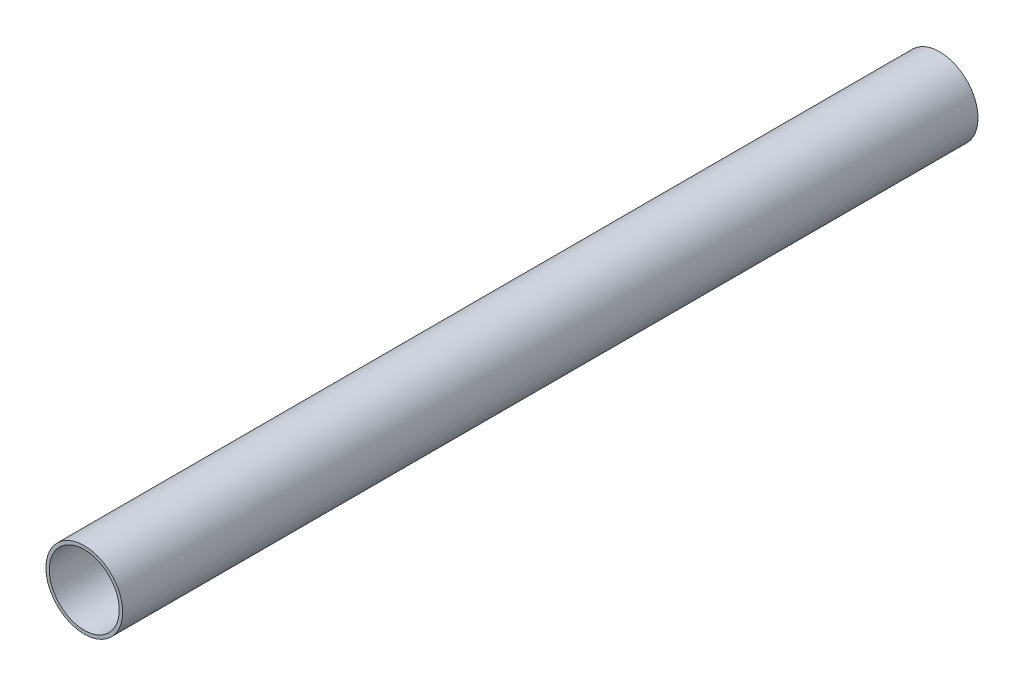
ISO-10303-21;
HEADER;
FILE_DESCRIPTION(('STEP AP214'),'2;1');
FILE_NAME('part.step','',(''),(''),'','','');
FILE_SCHEMA(('AUTOMOTIVE_DESIGN { 1 0 10303 214 1 1 1 1 }'));
ENDSEC;
DATA;
#1=APPLICATION_CONTEXT('core data for automotive mechanical design processes');
#2=APPLICATION_PROTOCOL_DEFINITION('international standard','automotive_design',2000,#1);
#3=PRODUCT_CONTEXT('',#1,'mechanical');
#4=PRODUCT('Part','Part','',(#3));
#5=PRODUCT_RELATED_PRODUCT_CATEGORY('part','',(#4));
#6=PRODUCT_DEFINITION_FORMATION('','',#4);
#7=PRODUCT_DEFINITION_CONTEXT('part definition',#1,'design');
#8=PRODUCT_DEFINITION('design','',#6,#7);
#9=PRODUCT_DEFINITION_SHAPE('','',#8);
#10=(LENGTH_UNIT() NAMED_UNIT(*) SI_UNIT(.MILLI.,.METRE.));
#11=(NAMED_UNIT(*) PLANE_ANGLE_UNIT() SI_UNIT($,.RADIAN.));
#12=(NAMED_UNIT(*) SI_UNIT($,.STERADIAN.) SOLID_ANGLE_UNIT());
#13=UNCERTAINTY_MEASURE_WITH_UNIT(LENGTH_MEASURE(1.E-05),#10,'distance_accuracy_value','');
#14=(GEOMETRIC_REPRESENTATION_CONTEXT(3) GLOBAL_UNCERTAINTY_ASSIGNED_CONTEXT((#13)) GLOBAL_UNIT_ASSIGNED_CONTEXT((#10,
#11,#12)) REPRESENTATION_CONTEXT('',''));
#15=CARTESIAN_POINT('',(0.,0.,0.));
#16=DIRECTION('',(0.,0.,1.));
#17=DIRECTION('',(1.,0.,0.));
#18=AXIS2_PLACEMENT_3D('',#15,#16,#17);
#19=CARTESIAN_POINT('',(0.,0.,355.6));
#20=DIRECTION('',(0.,0.,1.));
#21=DIRECTION('',(1.,0.,0.));
#22=AXIS2_PLACEMENT_3D('',#19,#20,#21);
#23=PLANE('',#22);
#24=CARTESIAN_POINT('',(0.,0.,355.6));
#25=DIRECTION('',(0.,0.,1.));
#26=DIRECTION('',(1.,0.,0.));
#27=AXIS2_PLACEMENT_3D('',#24,#25,#26);
#28=CIRCLE('',#27,15.9385);
#29=CARTESIAN_POINT('',(15.9385,0.,355.6));
#30=VERTEX_POINT('',#29);
#31=EDGE_CURVE('E10',#30,#30,#28,.T.);
#32=ORIENTED_EDGE('',*,*,#31,.T.);
#33=EDGE_LOOP('',(#32));
#34=FACE_BOUND('',#33,.T.);
#35=CARTESIAN_POINT('',(0.,0.,355.6));
#36=DIRECTION('',(0.,0.,1.));
#37=DIRECTION('',(1.,0.,0.));
#38=AXIS2_PLACEMENT_3D('',#35,#36,#37);
#39=CIRCLE('',#38,14.5415);
#40=CARTESIAN_POINT('',(14.5415,0.,355.6));
#41=VERTEX_POINT('',#40);
#42=EDGE_CURVE('E44',#41,#41,#39,.T.);
#43=ORIENTED_EDGE('',*,*,#42,.F.);
#44=EDGE_LOOP('',(#43));
#45=FACE_BOUND('',#44,.T.);
#46=ADVANCED_FACE('F33',(#34,#45),#23,.T.);
#47=CARTESIAN_POINT('',(0.,0.,0.));
#48=DIRECTION('',(0.,0.,1.));
#49=DIRECTION('',(1.,0.,0.));
#50=AXIS2_PLACEMENT_3D('',#47,#48,#49);
#51=PLANE('',#50);
#52=CARTESIAN_POINT('',(0.,0.,0.));
#53=DIRECTION('',(0.,0.,1.));
#54=DIRECTION('',(1.,0.,0.));
#55=AXIS2_PLACEMENT_3D('',#52,#53,#54);
#56=CIRCLE('',#55,15.9385);
#57=CARTESIAN_POINT('',(15.9385,0.,0.));
#58=VERTEX_POINT('',#57);
#59=EDGE_CURVE('E37',#58,#58,#56,.T.);
#60=ORIENTED_EDGE('',*,*,#59,.F.);
#61=EDGE_LOOP('',(#60));
#62=FACE_BOUND('',#61,.T.);
#63=CARTESIAN_POINT('',(0.,0.,0.));
#64=DIRECTION('',(0.,0.,1.));
#65=DIRECTION('',(1.,0.,0.));
#66=AXIS2_PLACEMENT_3D('',#63,#64,#65);
#67=CIRCLE('',#66,14.5415);
#68=CARTESIAN_POINT('',(14.5415,0.,0.));
#69=VERTEX_POINT('',#68);
#70=EDGE_CURVE('E46',#69,#69,#67,.T.);
#71=ORIENTED_EDGE('',*,*,#70,.T.);
#72=EDGE_LOOP('',(#71));
#73=FACE_BOUND('',#72,.T.);
#74=ADVANCED_FACE('F56',(#62,#73),#51,.F.);
#75=CARTESIAN_POINT('',(0.,0.,355.6));
#76=DIRECTION('',(0.,0.,-1.));
#77=DIRECTION('',(-1.,0.,0.));
#78=AXIS2_PLACEMENT_3D('',#75,#76,#77);
#79=CYLINDRICAL_SURFACE('',#78,15.9385);
#80=ORIENTED_EDGE('',*,*,#31,.F.);
#81=EDGE_LOOP('',(#80));
#82=FACE_BOUND('',#81,.T.);
#83=ORIENTED_EDGE('',*,*,#59,.T.);
#84=EDGE_LOOP('',(#83));
#85=FACE_BOUND('',#84,.T.);
#86=ADVANCED_FACE('F35',(#82,#85),#79,.T.);
#87=CARTESIAN_POINT('',(0.,0.,355.6));
#88=DIRECTION('',(0.,0.,-1.));
#89=DIRECTION('',(-1.,0.,0.));
#90=AXIS2_PLACEMENT_3D('',#87,#88,#89);
#91=CYLINDRICAL_SURFACE('',#90,14.5415);
#92=ORIENTED_EDGE('',*,*,#42,.T.);
#93=EDGE_LOOP('',(#92));
#94=FACE_BOUND('',#93,.T.);
#95=ORIENTED_EDGE('',*,*,#70,.F.);
#96=EDGE_LOOP('',(#95));
#97=FACE_BOUND('',#96,.T.);
#98=ADVANCED_FACE('F52',(#94,#97),#91,.F.);
#99=CLOSED_SHELL('',(#46,#74,#86,#98));
#100=MANIFOLD_SOLID_BREP('B2',#99);
#101=ADVANCED_BREP_SHAPE_REPRESENTATION('',(#18,#100),#14);
#102=SHAPE_DEFINITION_REPRESENTATION(#9,#101);
ENDSEC;
END-ISO-10303-21;
